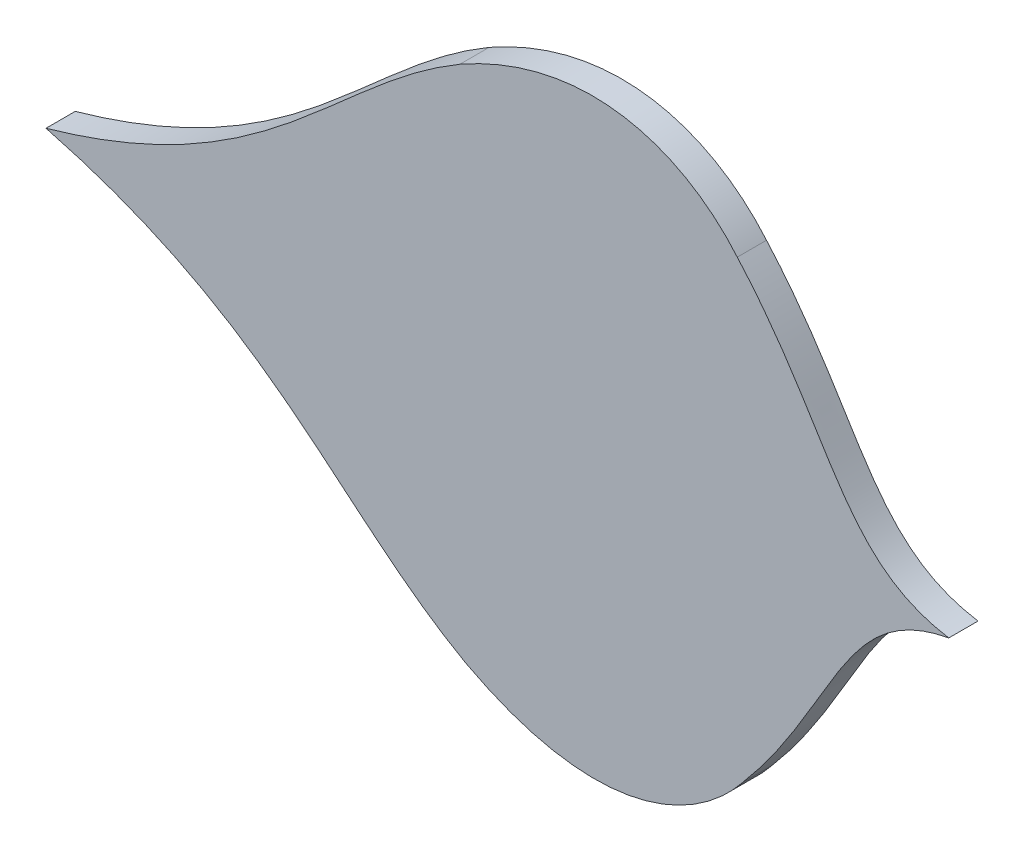
ISO-10303-21;
HEADER;
FILE_DESCRIPTION(('STEP AP214'),'2;1');
FILE_NAME('part.step','',(''),(''),'','','');
FILE_SCHEMA(('AUTOMOTIVE_DESIGN { 1 0 10303 214 1 1 1 1 }'));
ENDSEC;
DATA;
#1=APPLICATION_CONTEXT('core data for automotive mechanical design processes');
#2=APPLICATION_PROTOCOL_DEFINITION('international standard','automotive_design',2000,#1);
#3=PRODUCT_CONTEXT('',#1,'mechanical');
#4=PRODUCT('Part','Part','',(#3));
#5=PRODUCT_RELATED_PRODUCT_CATEGORY('part','',(#4));
#6=PRODUCT_DEFINITION_FORMATION('','',#4);
#7=PRODUCT_DEFINITION_CONTEXT('part definition',#1,'design');
#8=PRODUCT_DEFINITION('design','',#6,#7);
#9=PRODUCT_DEFINITION_SHAPE('','',#8);
#10=(LENGTH_UNIT() NAMED_UNIT(*) SI_UNIT(.MILLI.,.METRE.));
#11=(NAMED_UNIT(*) PLANE_ANGLE_UNIT() SI_UNIT($,.RADIAN.));
#12=(NAMED_UNIT(*) SI_UNIT($,.STERADIAN.) SOLID_ANGLE_UNIT());
#13=UNCERTAINTY_MEASURE_WITH_UNIT(LENGTH_MEASURE(1.E-05),#10,'distance_accuracy_value','');
#14=(GEOMETRIC_REPRESENTATION_CONTEXT(3) GLOBAL_UNCERTAINTY_ASSIGNED_CONTEXT((#13)) GLOBAL_UNIT_ASSIGNED_CONTEXT((#10,
#11,#12)) REPRESENTATION_CONTEXT('',''));
#15=CARTESIAN_POINT('',(0.,0.,0.));
#16=DIRECTION('',(0.,0.,1.));
#17=DIRECTION('',(1.,0.,0.));
#18=AXIS2_PLACEMENT_3D('',#15,#16,#17);
#19=CARTESIAN_POINT('',(1345.67567605873,682.526921773395,10.));
#20=CARTESIAN_POINT('',(1377.69025569495,719.883825382986,10.));
#21=CARTESIAN_POINT('',(1379.82759663995,754.050522933731,10.));
#22=CARTESIAN_POINT('',(1416.34096306229,760.768025017495,10.));
#23=B_SPLINE_CURVE_WITH_KNOTS('',3,(#19,#20,#21,#22),.UNSPECIFIED.,.F.,.F.,(4,4),(0.,1.),.UNSPECIFIED.);
#24=DIRECTION('',(0.,0.,-1.));
#25=VECTOR('',#24,1.);
#26=SURFACE_OF_LINEAR_EXTRUSION('',#23,#25);
#27=CARTESIAN_POINT('',(1345.67567605873,682.526921773395,0.));
#28=CARTESIAN_POINT('',(1377.69025569495,719.883825382986,0.));
#29=CARTESIAN_POINT('',(1379.82759663995,754.050522933731,0.));
#30=CARTESIAN_POINT('',(1416.34096306229,760.768025017495,0.));
#31=B_SPLINE_CURVE_WITH_KNOTS('',3,(#27,#28,#29,#30),.UNSPECIFIED.,.F.,.F.,(4,4),(0.,1.),.UNSPECIFIED.);
#32=CARTESIAN_POINT('',(1345.67567605873,682.526921773395,0.));
#33=VERTEX_POINT('',#32);
#34=CARTESIAN_POINT('',(1416.34096306229,760.768025017495,0.));
#35=VERTEX_POINT('',#34);
#36=EDGE_CURVE('E185',#33,#35,#31,.T.);
#37=ORIENTED_EDGE('',*,*,#36,.T.);
#38=DIRECTION('',(0.,0.,-1.));
#39=VECTOR('',#38,1.);
#40=CARTESIAN_POINT('',(1416.34096306229,760.768025017495,10.));
#41=LINE('',#40,#39);
#42=CARTESIAN_POINT('',(1416.34096306229,760.768025017495,10.));
#43=VERTEX_POINT('',#42);
#44=EDGE_CURVE('E11',#43,#35,#41,.T.);
#45=ORIENTED_EDGE('',*,*,#44,.F.);
#46=CARTESIAN_POINT('',(1345.67567605873,682.526921773395,10.));
#47=VERTEX_POINT('',#46);
#48=EDGE_CURVE('E152',#47,#43,#23,.T.);
#49=ORIENTED_EDGE('',*,*,#48,.F.);
#50=DIRECTION('',(0.,0.,-1.));
#51=VECTOR('',#50,1.);
#52=CARTESIAN_POINT('',(1345.67567605873,682.526921773395,10.));
#53=LINE('',#52,#51);
#54=EDGE_CURVE('E114',#47,#33,#53,.T.);
#55=ORIENTED_EDGE('',*,*,#54,.T.);
#56=EDGE_LOOP('',(#37,#45,#49,#55));
#57=FACE_BOUND('',#56,.T.);
#58=ADVANCED_FACE('F33',(#57),#26,.F.);
#59=CARTESIAN_POINT('',(1416.34096306229,760.768025017495,10.));
#60=CARTESIAN_POINT('',(1379.68807689091,766.677060221771,10.));
#61=CARTESIAN_POINT('',(1376.79628484567,800.788187242237,10.));
#62=CARTESIAN_POINT('',(1343.96405584042,837.428551529823,10.));
#63=B_SPLINE_CURVE_WITH_KNOTS('',3,(#59,#60,#61,#62),.UNSPECIFIED.,.F.,.F.,(4,4),(0.,1.),.UNSPECIFIED.);
#64=DIRECTION('',(0.,0.,-1.));
#65=VECTOR('',#64,1.);
#66=SURFACE_OF_LINEAR_EXTRUSION('',#63,#65);
#67=CARTESIAN_POINT('',(1416.34096306229,760.768025017495,0.));
#68=CARTESIAN_POINT('',(1379.68807689091,766.677060221771,0.));
#69=CARTESIAN_POINT('',(1376.79628484567,800.788187242237,0.));
#70=CARTESIAN_POINT('',(1343.96405584042,837.428551529823,0.));
#71=B_SPLINE_CURVE_WITH_KNOTS('',3,(#67,#68,#69,#70),.UNSPECIFIED.,.F.,.F.,(4,4),(0.,1.),.UNSPECIFIED.);
#72=CARTESIAN_POINT('',(1343.96405584042,837.428551529823,0.));
#73=VERTEX_POINT('',#72);
#74=EDGE_CURVE('E183',#35,#73,#71,.T.);
#75=ORIENTED_EDGE('',*,*,#74,.T.);
#76=DIRECTION('',(0.,0.,-1.));
#77=VECTOR('',#76,1.);
#78=CARTESIAN_POINT('',(1343.96405584042,837.428551529823,10.));
#79=LINE('',#78,#77);
#80=CARTESIAN_POINT('',(1343.96405584042,837.428551529823,10.));
#81=VERTEX_POINT('',#80);
#82=EDGE_CURVE('E42',#81,#73,#79,.T.);
#83=ORIENTED_EDGE('',*,*,#82,.F.);
#84=EDGE_CURVE('E87',#43,#81,#63,.T.);
#85=ORIENTED_EDGE('',*,*,#84,.F.);
#86=ORIENTED_EDGE('',*,*,#44,.T.);
#87=EDGE_LOOP('',(#75,#83,#85,#86));
#88=FACE_BOUND('',#87,.T.);
#89=ADVANCED_FACE('F140',(#88),#66,.F.);
#90=CARTESIAN_POINT('',(1343.96405584042,837.428551529823,10.));
#91=CARTESIAN_POINT('',(1328.16622810558,856.300178666648,10.));
#92=CARTESIAN_POINT('',(1295.27723109073,873.151464740273,10.));
#93=CARTESIAN_POINT('',(1249.07433727737,847.162336970258,10.));
#94=B_SPLINE_CURVE_WITH_KNOTS('',3,(#90,#91,#92,#93),.UNSPECIFIED.,.F.,.F.,(4,4),(0.,1.),.UNSPECIFIED.);
#95=DIRECTION('',(0.,0.,-1.));
#96=VECTOR('',#95,1.);
#97=SURFACE_OF_LINEAR_EXTRUSION('',#94,#96);
#98=CARTESIAN_POINT('',(1343.96405584042,837.428551529823,0.));
#99=CARTESIAN_POINT('',(1328.16622810558,856.300178666648,0.));
#100=CARTESIAN_POINT('',(1295.27723109073,873.151464740273,0.));
#101=CARTESIAN_POINT('',(1249.07433727737,847.162336970258,0.));
#102=B_SPLINE_CURVE_WITH_KNOTS('',3,(#98,#99,#100,#101),.UNSPECIFIED.,.F.,.F.,(4,4),(0.,1.),.UNSPECIFIED.);
#103=CARTESIAN_POINT('',(1249.07433727737,847.162336970258,0.));
#104=VERTEX_POINT('',#103);
#105=EDGE_CURVE('E179',#73,#104,#102,.T.);
#106=ORIENTED_EDGE('',*,*,#105,.T.);
#107=DIRECTION('',(0.,0.,-1.));
#108=VECTOR('',#107,1.);
#109=CARTESIAN_POINT('',(1249.07433727737,847.162336970258,10.));
#110=LINE('',#109,#108);
#111=CARTESIAN_POINT('',(1249.07433727737,847.162336970258,10.));
#112=VERTEX_POINT('',#111);
#113=EDGE_CURVE('E109',#112,#104,#110,.T.);
#114=ORIENTED_EDGE('',*,*,#113,.F.);
#115=EDGE_CURVE('E100',#81,#112,#94,.T.);
#116=ORIENTED_EDGE('',*,*,#115,.F.);
#117=ORIENTED_EDGE('',*,*,#82,.T.);
#118=EDGE_LOOP('',(#106,#114,#116,#117));
#119=FACE_BOUND('',#118,.T.);
#120=ADVANCED_FACE('F138',(#119),#97,.F.);
#121=CARTESIAN_POINT('',(1249.07433727737,847.162336970258,10.));
#122=CARTESIAN_POINT('',(1205.44891136109,821.536040113524,10.));
#123=CARTESIAN_POINT('',(1185.29886024953,779.453471672191,10.));
#124=CARTESIAN_POINT('',(1107.41616339606,757.354491319526,10.));
#125=B_SPLINE_CURVE_WITH_KNOTS('',3,(#121,#122,#123,#124),.UNSPECIFIED.,.F.,.F.,(4,4),(0.,1.),.UNSPECIFIED.);
#126=DIRECTION('',(0.,0.,-1.));
#127=VECTOR('',#126,1.);
#128=SURFACE_OF_LINEAR_EXTRUSION('',#125,#127);
#129=CARTESIAN_POINT('',(1249.07433727737,847.162336970258,0.));
#130=CARTESIAN_POINT('',(1205.44891136109,821.536040113524,0.));
#131=CARTESIAN_POINT('',(1185.29886024953,779.453471672191,0.));
#132=CARTESIAN_POINT('',(1107.41616339606,757.354491319526,0.));
#133=B_SPLINE_CURVE_WITH_KNOTS('',3,(#129,#130,#131,#132),.UNSPECIFIED.,.F.,.F.,(4,4),(0.,1.),.UNSPECIFIED.);
#134=CARTESIAN_POINT('',(1107.41616339606,757.354491319526,0.));
#135=VERTEX_POINT('',#134);
#136=EDGE_CURVE('E108',#104,#135,#133,.T.);
#137=ORIENTED_EDGE('',*,*,#136,.T.);
#138=DIRECTION('',(0.,0.,-1.));
#139=VECTOR('',#138,1.);
#140=CARTESIAN_POINT('',(1107.41616339606,757.354491319526,10.));
#141=LINE('',#140,#139);
#142=CARTESIAN_POINT('',(1107.41616339606,757.354491319526,10.));
#143=VERTEX_POINT('',#142);
#144=EDGE_CURVE('E105',#143,#135,#141,.T.);
#145=ORIENTED_EDGE('',*,*,#144,.F.);
#146=EDGE_CURVE('E94',#112,#143,#125,.T.);
#147=ORIENTED_EDGE('',*,*,#146,.F.);
#148=ORIENTED_EDGE('',*,*,#113,.T.);
#149=EDGE_LOOP('',(#137,#145,#147,#148));
#150=FACE_BOUND('',#149,.T.);
#151=ADVANCED_FACE('F106',(#150),#128,.F.);
#152=CARTESIAN_POINT('',(1107.41616339606,757.354491319526,10.));
#153=CARTESIAN_POINT('',(1185.7681598131,736.981861168745,10.));
#154=CARTESIAN_POINT('',(1206.84317900471,695.354818366121,10.));
#155=CARTESIAN_POINT('',(1251.02421107136,670.69875861417,10.));
#156=B_SPLINE_CURVE_WITH_KNOTS('',3,(#152,#153,#154,#155),.UNSPECIFIED.,.F.,.F.,(4,4),(0.,1.),.UNSPECIFIED.);
#157=DIRECTION('',(0.,0.,-1.));
#158=VECTOR('',#157,1.);
#159=SURFACE_OF_LINEAR_EXTRUSION('',#156,#158);
#160=CARTESIAN_POINT('',(1107.41616339606,757.354491319526,0.));
#161=CARTESIAN_POINT('',(1185.7681598131,736.981861168745,0.));
#162=CARTESIAN_POINT('',(1206.84317900471,695.354818366121,0.));
#163=CARTESIAN_POINT('',(1251.02421107136,670.69875861417,0.));
#164=B_SPLINE_CURVE_WITH_KNOTS('',3,(#160,#161,#162,#163),.UNSPECIFIED.,.F.,.F.,(4,4),(0.,1.),.UNSPECIFIED.);
#165=CARTESIAN_POINT('',(1251.02421107136,670.69875861417,0.));
#166=VERTEX_POINT('',#165);
#167=EDGE_CURVE('E73',#135,#166,#164,.T.);
#168=ORIENTED_EDGE('',*,*,#167,.T.);
#169=DIRECTION('',(0.,0.,-1.));
#170=VECTOR('',#169,1.);
#171=CARTESIAN_POINT('',(1251.02421107136,670.69875861417,10.));
#172=LINE('',#171,#170);
#173=CARTESIAN_POINT('',(1251.02421107136,670.69875861417,10.));
#174=VERTEX_POINT('',#173);
#175=EDGE_CURVE('E110',#174,#166,#172,.T.);
#176=ORIENTED_EDGE('',*,*,#175,.F.);
#177=EDGE_CURVE('E98',#143,#174,#156,.T.);
#178=ORIENTED_EDGE('',*,*,#177,.F.);
#179=ORIENTED_EDGE('',*,*,#144,.T.);
#180=EDGE_LOOP('',(#168,#176,#178,#179));
#181=FACE_BOUND('',#180,.T.);
#182=ADVANCED_FACE('F112',(#181),#159,.F.);
#183=CARTESIAN_POINT('',(1251.02421107136,670.69875861417,10.));
#184=CARTESIAN_POINT('',(1297.79009909668,645.736910201489,10.));
#185=CARTESIAN_POINT('',(1330.29870718758,663.310821745896,10.));
#186=CARTESIAN_POINT('',(1345.67567605873,682.526921773395,10.));
#187=B_SPLINE_CURVE_WITH_KNOTS('',3,(#183,#184,#185,#186),.UNSPECIFIED.,.F.,.F.,(4,4),(0.,1.),.UNSPECIFIED.);
#188=DIRECTION('',(0.,0.,-1.));
#189=VECTOR('',#188,1.);
#190=SURFACE_OF_LINEAR_EXTRUSION('',#187,#189);
#191=CARTESIAN_POINT('',(1251.02421107136,670.69875861417,0.));
#192=CARTESIAN_POINT('',(1297.79009909668,645.736910201489,0.));
#193=CARTESIAN_POINT('',(1330.29870718758,663.310821745896,0.));
#194=CARTESIAN_POINT('',(1345.67567605873,682.526921773395,0.));
#195=B_SPLINE_CURVE_WITH_KNOTS('',3,(#191,#192,#193,#194),.UNSPECIFIED.,.F.,.F.,(4,4),(0.,1.),.UNSPECIFIED.);
#196=EDGE_CURVE('E79',#166,#33,#195,.T.);
#197=ORIENTED_EDGE('',*,*,#196,.T.);
#198=ORIENTED_EDGE('',*,*,#54,.F.);
#199=EDGE_CURVE('E50',#174,#47,#187,.T.);
#200=ORIENTED_EDGE('',*,*,#199,.F.);
#201=ORIENTED_EDGE('',*,*,#175,.T.);
#202=EDGE_LOOP('',(#197,#198,#200,#201));
#203=FACE_BOUND('',#202,.T.);
#204=ADVANCED_FACE('F134',(#203),#190,.F.);
#205=CARTESIAN_POINT('',(1379.32127451571,733.13724896763,10.));
#206=DIRECTION('',(0.,0.,-1.));
#207=DIRECTION('',(-1.,0.,0.));
#208=AXIS2_PLACEMENT_3D('',#205,#206,#207);
#209=PLANE('',#208);
#210=ORIENTED_EDGE('',*,*,#48,.T.);
#211=ORIENTED_EDGE('',*,*,#84,.T.);
#212=ORIENTED_EDGE('',*,*,#115,.T.);
#213=ORIENTED_EDGE('',*,*,#146,.T.);
#214=ORIENTED_EDGE('',*,*,#177,.T.);
#215=ORIENTED_EDGE('',*,*,#199,.T.);
#216=EDGE_LOOP('',(#210,#211,#212,#213,#214,#215));
#217=FACE_BOUND('',#216,.T.);
#218=ADVANCED_FACE('F96',(#217),#209,.F.);
#219=CARTESIAN_POINT('',(1379.32127451571,733.13724896763,0.));
#220=DIRECTION('',(0.,0.,-1.));
#221=DIRECTION('',(-1.,0.,0.));
#222=AXIS2_PLACEMENT_3D('',#219,#220,#221);
#223=PLANE('',#222);
#224=ORIENTED_EDGE('',*,*,#36,.F.);
#225=ORIENTED_EDGE('',*,*,#196,.F.);
#226=ORIENTED_EDGE('',*,*,#167,.F.);
#227=ORIENTED_EDGE('',*,*,#136,.F.);
#228=ORIENTED_EDGE('',*,*,#105,.F.);
#229=ORIENTED_EDGE('',*,*,#74,.F.);
#230=EDGE_LOOP('',(#224,#225,#226,#227,#228,#229));
#231=FACE_BOUND('',#230,.T.);
#232=ADVANCED_FACE('F182',(#231),#223,.T.);
#233=CLOSED_SHELL('',(#58,#89,#120,#151,#182,#204,#218,#232));
#234=MANIFOLD_SOLID_BREP('B2',#233);
#235=ADVANCED_BREP_SHAPE_REPRESENTATION('',(#18,#234),#14);
#236=SHAPE_DEFINITION_REPRESENTATION(#9,#235);
ENDSEC;
END-ISO-10303-21;
